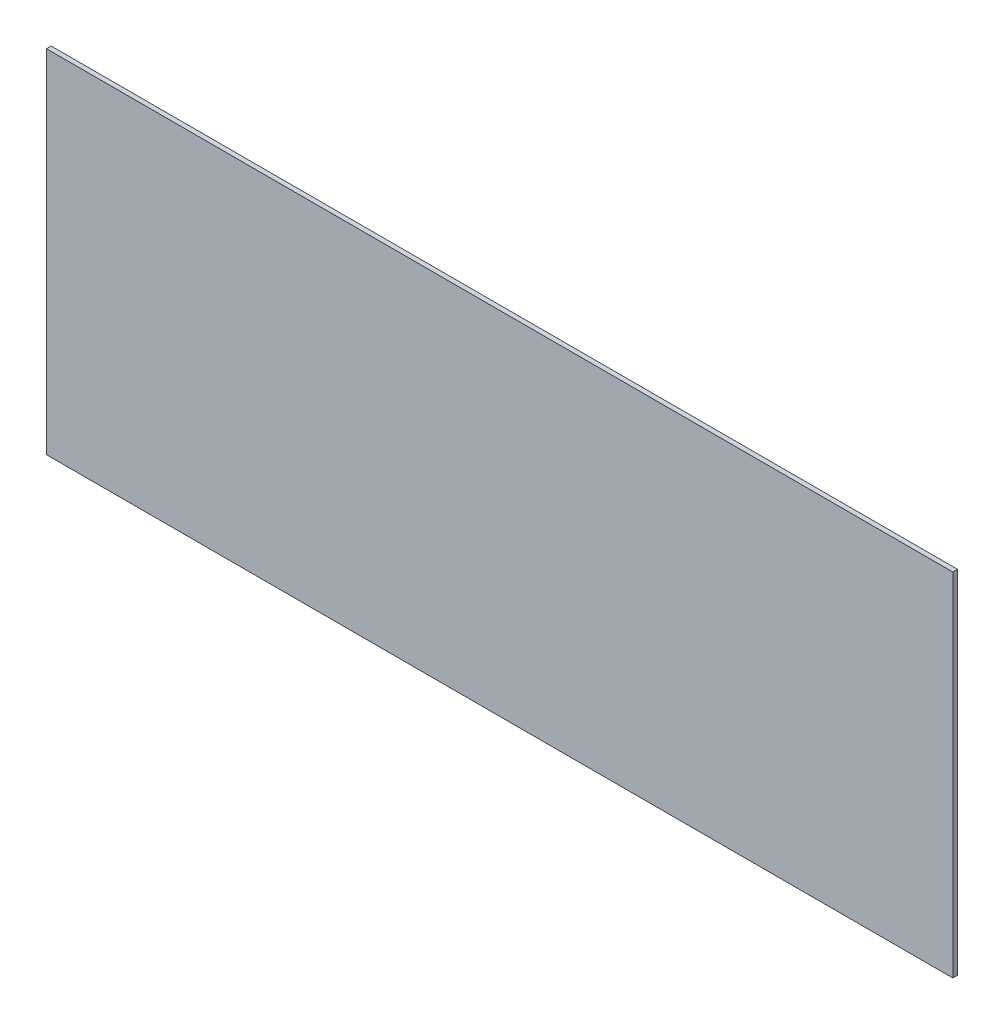
ISO-10303-21;
HEADER;
FILE_DESCRIPTION(('STEP AP214'),'2;1');
FILE_NAME('part.step','',(''),(''),'','','');
FILE_SCHEMA(('AUTOMOTIVE_DESIGN { 1 0 10303 214 1 1 1 1 }'));
ENDSEC;
DATA;
#1=APPLICATION_CONTEXT('core data for automotive mechanical design processes');
#2=APPLICATION_PROTOCOL_DEFINITION('international standard','automotive_design',2000,#1);
#3=PRODUCT_CONTEXT('',#1,'mechanical');
#4=PRODUCT('Part','Part','',(#3));
#5=PRODUCT_RELATED_PRODUCT_CATEGORY('part','',(#4));
#6=PRODUCT_DEFINITION_FORMATION('','',#4);
#7=PRODUCT_DEFINITION_CONTEXT('part definition',#1,'design');
#8=PRODUCT_DEFINITION('design','',#6,#7);
#9=PRODUCT_DEFINITION_SHAPE('','',#8);
#10=(LENGTH_UNIT() NAMED_UNIT(*) SI_UNIT(.MILLI.,.METRE.));
#11=(NAMED_UNIT(*) PLANE_ANGLE_UNIT() SI_UNIT($,.RADIAN.));
#12=(NAMED_UNIT(*) SI_UNIT($,.STERADIAN.) SOLID_ANGLE_UNIT());
#13=UNCERTAINTY_MEASURE_WITH_UNIT(LENGTH_MEASURE(1.E-05),#10,'distance_accuracy_value','');
#14=(GEOMETRIC_REPRESENTATION_CONTEXT(3) GLOBAL_UNCERTAINTY_ASSIGNED_CONTEXT((#13)) GLOBAL_UNIT_ASSIGNED_CONTEXT((#10,
#11,#12)) REPRESENTATION_CONTEXT('',''));
#15=CARTESIAN_POINT('',(0.,0.,0.));
#16=DIRECTION('',(0.,0.,1.));
#17=DIRECTION('',(1.,0.,0.));
#18=AXIS2_PLACEMENT_3D('',#15,#16,#17);
#19=CARTESIAN_POINT('',(-151.647219590123,64.9097472924187,1.5));
#20=DIRECTION('',(1.,0.,0.));
#21=DIRECTION('',(0.,1.,0.));
#22=AXIS2_PLACEMENT_3D('',#19,#20,#21);
#23=PLANE('',#22);
#24=DIRECTION('',(0.,-1.,0.));
#25=VECTOR('',#24,1.);
#26=CARTESIAN_POINT('',(-151.647219590123,64.9097472924187,0.));
#27=LINE('',#26,#25);
#28=CARTESIAN_POINT('',(-151.647219590123,64.9097472924187,0.));
#29=VERTEX_POINT('',#28);
#30=CARTESIAN_POINT('',(-151.647219590124,-47.5902527075813,0.));
#31=VERTEX_POINT('',#30);
#32=EDGE_CURVE('E107',#29,#31,#27,.T.);
#33=ORIENTED_EDGE('',*,*,#32,.T.);
#34=DIRECTION('',(0.,0.,-1.));
#35=VECTOR('',#34,1.);
#36=CARTESIAN_POINT('',(-151.647219590124,-47.5902527075813,1.5));
#37=LINE('',#36,#35);
#38=CARTESIAN_POINT('',(-151.647219590124,-47.5902527075813,1.5));
#39=VERTEX_POINT('',#38);
#40=EDGE_CURVE('E11',#39,#31,#37,.T.);
#41=ORIENTED_EDGE('',*,*,#40,.F.);
#42=DIRECTION('',(0.,-1.,0.));
#43=VECTOR('',#42,1.);
#44=CARTESIAN_POINT('',(-151.647219590123,64.9097472924187,1.5));
#45=LINE('',#44,#43);
#46=CARTESIAN_POINT('',(-151.647219590123,64.9097472924187,1.5));
#47=VERTEX_POINT('',#46);
#48=EDGE_CURVE('E91',#47,#39,#45,.T.);
#49=ORIENTED_EDGE('',*,*,#48,.F.);
#50=DIRECTION('',(0.,0.,-1.));
#51=VECTOR('',#50,1.);
#52=CARTESIAN_POINT('',(-151.647219590123,64.9097472924187,1.5));
#53=LINE('',#52,#51);
#54=EDGE_CURVE('E103',#47,#29,#53,.T.);
#55=ORIENTED_EDGE('',*,*,#54,.T.);
#56=EDGE_LOOP('',(#33,#41,#49,#55));
#57=FACE_BOUND('',#56,.T.);
#58=ADVANCED_FACE('F39',(#57),#23,.F.);
#59=CARTESIAN_POINT('',(-151.647219590124,-47.5902527075813,1.5));
#60=DIRECTION('',(0.,1.,0.));
#61=DIRECTION('',(0.,0.,1.));
#62=AXIS2_PLACEMENT_3D('',#59,#60,#61);
#63=PLANE('',#62);
#64=DIRECTION('',(1.,0.,0.));
#65=VECTOR('',#64,1.);
#66=CARTESIAN_POINT('',(-151.647219590124,-47.5902527075813,0.));
#67=LINE('',#66,#65);
#68=CARTESIAN_POINT('',(138.352780409877,-47.5902527075813,0.));
#69=VERTEX_POINT('',#68);
#70=EDGE_CURVE('E96',#31,#69,#67,.T.);
#71=ORIENTED_EDGE('',*,*,#70,.T.);
#72=DIRECTION('',(0.,0.,-1.));
#73=VECTOR('',#72,1.);
#74=CARTESIAN_POINT('',(138.352780409877,-47.5902527075813,1.5));
#75=LINE('',#74,#73);
#76=CARTESIAN_POINT('',(138.352780409877,-47.5902527075813,1.5));
#77=VERTEX_POINT('',#76);
#78=EDGE_CURVE('E48',#77,#69,#75,.T.);
#79=ORIENTED_EDGE('',*,*,#78,.F.);
#80=DIRECTION('',(1.,0.,0.));
#81=VECTOR('',#80,1.);
#82=CARTESIAN_POINT('',(-151.647219590124,-47.5902527075813,1.5));
#83=LINE('',#82,#81);
#84=EDGE_CURVE('E86',#39,#77,#83,.T.);
#85=ORIENTED_EDGE('',*,*,#84,.F.);
#86=ORIENTED_EDGE('',*,*,#40,.T.);
#87=EDGE_LOOP('',(#71,#79,#85,#86));
#88=FACE_BOUND('',#87,.T.);
#89=ADVANCED_FACE('F95',(#88),#63,.F.);
#90=CARTESIAN_POINT('',(138.352780409877,64.9097472924187,1.5));
#91=DIRECTION('',(-1.,0.,0.));
#92=DIRECTION('',(0.,0.,1.));
#93=AXIS2_PLACEMENT_3D('',#90,#91,#92);
#94=PLANE('',#93);
#95=DIRECTION('',(0.,1.,0.));
#96=VECTOR('',#95,1.);
#97=CARTESIAN_POINT('',(138.352780409877,64.9097472924187,0.));
#98=LINE('',#97,#96);
#99=CARTESIAN_POINT('',(138.352780409877,64.9097472924187,0.));
#100=VERTEX_POINT('',#99);
#101=EDGE_CURVE('E73',#69,#100,#98,.T.);
#102=ORIENTED_EDGE('',*,*,#101,.T.);
#103=DIRECTION('',(0.,0.,-1.));
#104=VECTOR('',#103,1.);
#105=CARTESIAN_POINT('',(138.352780409877,64.9097472924187,1.5));
#106=LINE('',#105,#104);
#107=CARTESIAN_POINT('',(138.352780409877,64.9097472924187,1.5));
#108=VERTEX_POINT('',#107);
#109=EDGE_CURVE('E98',#108,#100,#106,.T.);
#110=ORIENTED_EDGE('',*,*,#109,.F.);
#111=DIRECTION('',(0.,1.,0.));
#112=VECTOR('',#111,1.);
#113=CARTESIAN_POINT('',(138.352780409877,64.9097472924187,1.5));
#114=LINE('',#113,#112);
#115=EDGE_CURVE('E89',#77,#108,#114,.T.);
#116=ORIENTED_EDGE('',*,*,#115,.F.);
#117=ORIENTED_EDGE('',*,*,#78,.T.);
#118=EDGE_LOOP('',(#102,#110,#116,#117));
#119=FACE_BOUND('',#118,.T.);
#120=ADVANCED_FACE('F99',(#119),#94,.F.);
#121=CARTESIAN_POINT('',(-151.647219590123,64.9097472924187,1.5));
#122=DIRECTION('',(0.,-1.,0.));
#123=DIRECTION('',(0.,0.,-1.));
#124=AXIS2_PLACEMENT_3D('',#121,#122,#123);
#125=PLANE('',#124);
#126=DIRECTION('',(-1.,0.,0.));
#127=VECTOR('',#126,1.);
#128=CARTESIAN_POINT('',(-151.647219590123,64.9097472924187,0.));
#129=LINE('',#128,#127);
#130=EDGE_CURVE('E79',#100,#29,#129,.T.);
#131=ORIENTED_EDGE('',*,*,#130,.T.);
#132=ORIENTED_EDGE('',*,*,#54,.F.);
#133=DIRECTION('',(-1.,0.,0.));
#134=VECTOR('',#133,1.);
#135=CARTESIAN_POINT('',(-151.647219590123,64.9097472924187,1.5));
#136=LINE('',#135,#134);
#137=EDGE_CURVE('E56',#108,#47,#136,.T.);
#138=ORIENTED_EDGE('',*,*,#137,.F.);
#139=ORIENTED_EDGE('',*,*,#109,.T.);
#140=EDGE_LOOP('',(#131,#132,#138,#139));
#141=FACE_BOUND('',#140,.T.);
#142=ADVANCED_FACE('F120',(#141),#125,.F.);
#143=CARTESIAN_POINT('',(0.,0.,1.5));
#144=DIRECTION('',(0.,0.,1.));
#145=DIRECTION('',(1.,0.,0.));
#146=AXIS2_PLACEMENT_3D('',#143,#144,#145);
#147=PLANE('',#146);
#148=ORIENTED_EDGE('',*,*,#48,.T.);
#149=ORIENTED_EDGE('',*,*,#84,.T.);
#150=ORIENTED_EDGE('',*,*,#115,.T.);
#151=ORIENTED_EDGE('',*,*,#137,.T.);
#152=EDGE_LOOP('',(#148,#149,#150,#151));
#153=FACE_BOUND('',#152,.T.);
#154=ADVANCED_FACE('F87',(#153),#147,.T.);
#155=CARTESIAN_POINT('',(0.,0.,0.));
#156=DIRECTION('',(0.,0.,1.));
#157=DIRECTION('',(1.,0.,0.));
#158=AXIS2_PLACEMENT_3D('',#155,#156,#157);
#159=PLANE('',#158);
#160=ORIENTED_EDGE('',*,*,#32,.F.);
#161=ORIENTED_EDGE('',*,*,#130,.F.);
#162=ORIENTED_EDGE('',*,*,#101,.F.);
#163=ORIENTED_EDGE('',*,*,#70,.F.);
#164=EDGE_LOOP('',(#160,#161,#162,#163));
#165=FACE_BOUND('',#164,.T.);
#166=ADVANCED_FACE('F123',(#165),#159,.F.);
#167=CLOSED_SHELL('',(#58,#89,#120,#142,#154,#166));
#168=MANIFOLD_SOLID_BREP('B2',#167);
#169=ADVANCED_BREP_SHAPE_REPRESENTATION('',(#18,#168),#14);
#170=SHAPE_DEFINITION_REPRESENTATION(#9,#169);
ENDSEC;
END-ISO-10303-21;
